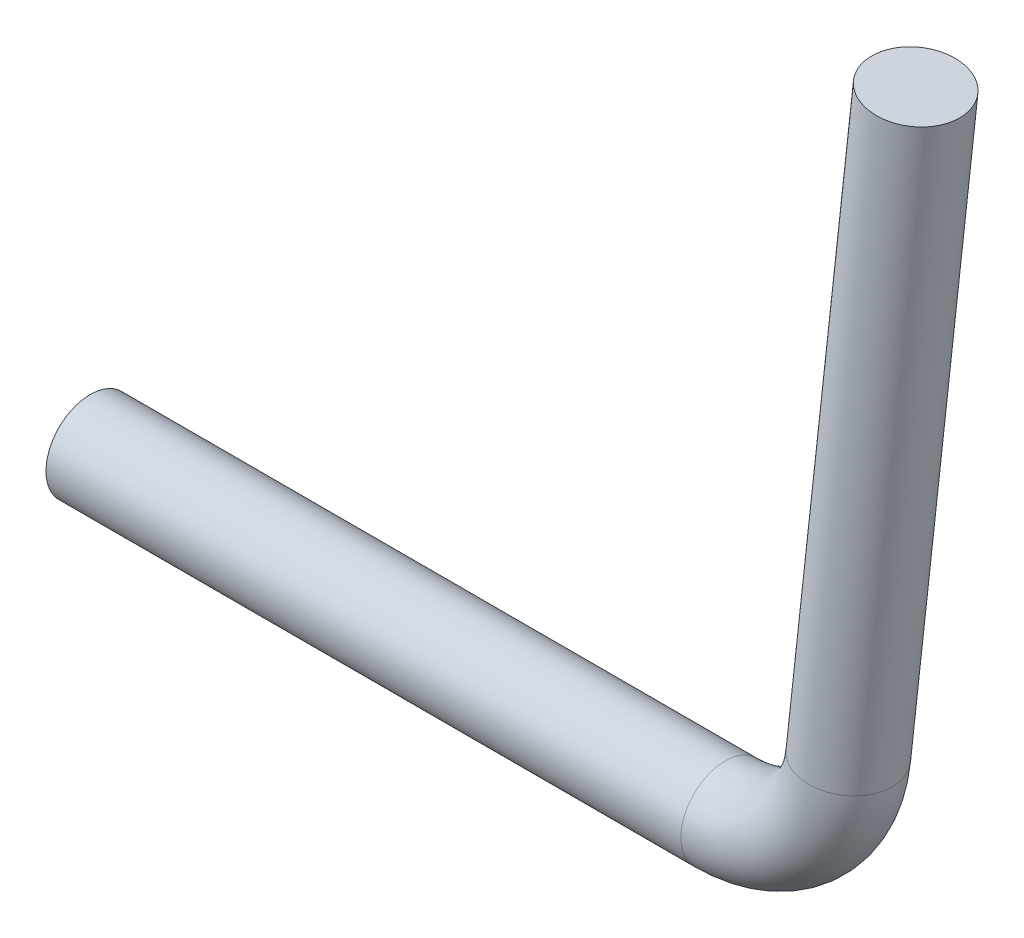
ISO-10303-21;
HEADER;
FILE_DESCRIPTION(('STEP AP214'),'2;1');
FILE_NAME('part.step','',(''),(''),'','','');
FILE_SCHEMA(('AUTOMOTIVE_DESIGN { 1 0 10303 214 1 1 1 1 }'));
ENDSEC;
DATA;
#1=APPLICATION_CONTEXT('core data for automotive mechanical design processes');
#2=APPLICATION_PROTOCOL_DEFINITION('international standard','automotive_design',2000,#1);
#3=PRODUCT_CONTEXT('',#1,'mechanical');
#4=PRODUCT('Part','Part','',(#3));
#5=PRODUCT_RELATED_PRODUCT_CATEGORY('part','',(#4));
#6=PRODUCT_DEFINITION_FORMATION('','',#4);
#7=PRODUCT_DEFINITION_CONTEXT('part definition',#1,'design');
#8=PRODUCT_DEFINITION('design','',#6,#7);
#9=PRODUCT_DEFINITION_SHAPE('','',#8);
#10=(LENGTH_UNIT() NAMED_UNIT(*) SI_UNIT(.MILLI.,.METRE.));
#11=(NAMED_UNIT(*) PLANE_ANGLE_UNIT() SI_UNIT($,.RADIAN.));
#12=(NAMED_UNIT(*) SI_UNIT($,.STERADIAN.) SOLID_ANGLE_UNIT());
#13=UNCERTAINTY_MEASURE_WITH_UNIT(LENGTH_MEASURE(1.E-05),#10,'distance_accuracy_value','');
#14=(GEOMETRIC_REPRESENTATION_CONTEXT(3) GLOBAL_UNCERTAINTY_ASSIGNED_CONTEXT((#13)) GLOBAL_UNIT_ASSIGNED_CONTEXT((#10,
#11,#12)) REPRESENTATION_CONTEXT('',''));
#15=CARTESIAN_POINT('',(0.,0.,0.));
#16=DIRECTION('',(0.,0.,1.));
#17=DIRECTION('',(1.,0.,0.));
#18=AXIS2_PLACEMENT_3D('',#15,#16,#17);
#19=CARTESIAN_POINT('',(14.8299202293343,50.4800419903985,0.));
#20=DIRECTION('',(-0.109387470207136,-0.993999185795282,0.));
#21=DIRECTION('',(0.993999185795282,-0.109387470207136,0.));
#22=AXIS2_PLACEMENT_3D('',#19,#20,#21);
#23=PLANE('',#22);
#24=CARTESIAN_POINT('',(14.8299202293343,50.4800419903985,0.));
#25=DIRECTION('',(-0.109387470207136,-0.993999185795282,0.));
#26=DIRECTION('',(0.993999185795282,-0.109387470207136,0.));
#27=AXIS2_PLACEMENT_3D('',#24,#25,#26);
#28=CIRCLE('',#27,2.5);
#29=CARTESIAN_POINT('',(17.3149181938225,50.2065733148806,0.));
#30=VERTEX_POINT('',#29);
#31=EDGE_CURVE('E59',#30,#30,#28,.T.);
#32=ORIENTED_EDGE('',*,*,#31,.F.);
#33=EDGE_LOOP('',(#32));
#34=FACE_BOUND('',#33,.T.);
#35=ADVANCED_FACE('F45',(#34),#23,.F.);
#36=CARTESIAN_POINT('',(-31.8080343104226,9.61157978666293,0.));
#37=DIRECTION('',(-1.,0.,0.));
#38=DIRECTION('',(0.,-1.,0.));
#39=AXIS2_PLACEMENT_3D('',#36,#37,#38);
#40=PLANE('',#39);
#41=CARTESIAN_POINT('',(-31.8080343104226,9.61157978666293,0.));
#42=DIRECTION('',(-1.,0.,0.));
#43=DIRECTION('',(0.,-1.,0.));
#44=AXIS2_PLACEMENT_3D('',#41,#42,#43);
#45=CIRCLE('',#44,2.5);
#46=CARTESIAN_POINT('',(-31.8080343104226,7.11157978666293,0.));
#47=VERTEX_POINT('',#46);
#48=EDGE_CURVE('E11',#47,#47,#45,.T.);
#49=ORIENTED_EDGE('',*,*,#48,.T.);
#50=EDGE_LOOP('',(#49));
#51=FACE_BOUND('',#50,.T.);
#52=ADVANCED_FACE('F68',(#51),#40,.T.);
#53=CARTESIAN_POINT('',(14.8299202293343,50.4800419903985,0.));
#54=DIRECTION('',(-0.109387470207136,-0.993999185795282,0.));
#55=DIRECTION('',(0.993999185795282,-0.109387470207136,0.));
#56=AXIS2_PLACEMENT_3D('',#53,#54,#55);
#57=CYLINDRICAL_SURFACE('',#56,2.5);
#58=CARTESIAN_POINT('',(11.0185038973282,15.845867495213,0.));
#59=DIRECTION('',(-0.109387470207136,-0.993999185795282,0.));
#60=DIRECTION('',(0.993999185795282,-0.109387470207136,0.));
#61=AXIS2_PLACEMENT_3D('',#58,#59,#60);
#62=CIRCLE('',#61,2.5);
#63=CARTESIAN_POINT('',(13.5035018618165,15.5723988196952,0.));
#64=VERTEX_POINT('',#63);
#65=EDGE_CURVE('E55',#64,#64,#62,.T.);
#66=ORIENTED_EDGE('',*,*,#65,.F.);
#67=EDGE_LOOP('',(#66));
#68=FACE_BOUND('',#67,.T.);
#69=ORIENTED_EDGE('',*,*,#31,.T.);
#70=EDGE_LOOP('',(#69));
#71=FACE_BOUND('',#70,.T.);
#72=ADVANCED_FACE('F65',(#68,#71),#57,.T.);
#73=CARTESIAN_POINT('',(4.06050959676127,16.6115797866629,0.));
#74=DIRECTION('',(0.,0.,-1.));
#75=DIRECTION('',(-1.,0.,0.));
#76=AXIS2_PLACEMENT_3D('',#73,#74,#75);
#77=TOROIDAL_SURFACE('',#76,7.00000000000002,2.5);
#78=CARTESIAN_POINT('',(4.06050959676129,9.61157978666293,0.));
#79=DIRECTION('',(-1.,0.,0.));
#80=DIRECTION('',(0.,-1.,0.));
#81=AXIS2_PLACEMENT_3D('',#78,#79,#80);
#82=CIRCLE('',#81,2.5);
#83=CARTESIAN_POINT('',(4.0605095967613,7.11157978666292,0.));
#84=VERTEX_POINT('',#83);
#85=EDGE_CURVE('E51',#84,#84,#82,.T.);
#86=CARTESIAN_POINT('',(4.06050959676127,16.6115797866629,0.));
#87=DIRECTION('',(0.,0.,-1.));
#88=DIRECTION('',(-1.,0.,0.));
#89=AXIS2_PLACEMENT_3D('',#86,#87,#88);
#90=CIRCLE('',#89,9.50000000000002);
#91=EDGE_CURVE('',#64,#84,#90,.T.);
#92=ORIENTED_EDGE('',*,*,#65,.T.);
#93=ORIENTED_EDGE('',*,*,#85,.F.);
#94=ORIENTED_EDGE('',*,*,#91,.T.);
#95=ORIENTED_EDGE('',*,*,#91,.F.);
#96=EDGE_LOOP('',(#92,#94,#93,#95));
#97=FACE_BOUND('',#96,.T.);
#98=ADVANCED_FACE('F74',(#97),#77,.T.);
#99=CARTESIAN_POINT('',(4.06050959676129,9.61157978666293,0.));
#100=DIRECTION('',(-1.,0.,0.));
#101=DIRECTION('',(0.,0.,1.));
#102=AXIS2_PLACEMENT_3D('',#99,#100,#101);
#103=CYLINDRICAL_SURFACE('',#102,2.5);
#104=ORIENTED_EDGE('',*,*,#48,.F.);
#105=EDGE_LOOP('',(#104));
#106=FACE_BOUND('',#105,.T.);
#107=ORIENTED_EDGE('',*,*,#85,.T.);
#108=EDGE_LOOP('',(#107));
#109=FACE_BOUND('',#108,.T.);
#110=ADVANCED_FACE('F72',(#106,#109),#103,.T.);
#111=CLOSED_SHELL('',(#35,#52,#72,#98,#110));
#112=MANIFOLD_SOLID_BREP('B2',#111);
#113=ADVANCED_BREP_SHAPE_REPRESENTATION('',(#18,#112),#14);
#114=SHAPE_DEFINITION_REPRESENTATION(#9,#113);
ENDSEC;
END-ISO-10303-21;
